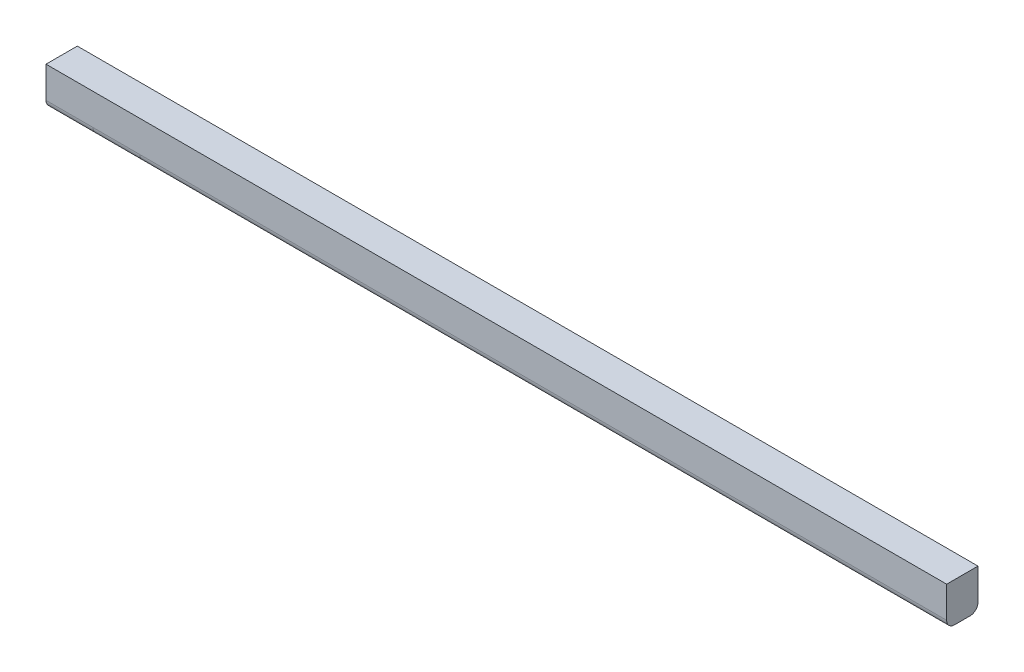
ISO-10303-21;
HEADER;
FILE_DESCRIPTION(('STEP AP214'),'2;1');
FILE_NAME('part.step','',(''),(''),'','','');
FILE_SCHEMA(('AUTOMOTIVE_DESIGN { 1 0 10303 214 1 1 1 1 }'));
ENDSEC;
DATA;
#1=APPLICATION_CONTEXT('core data for automotive mechanical design processes');
#2=APPLICATION_PROTOCOL_DEFINITION('international standard','automotive_design',2000,#1);
#3=PRODUCT_CONTEXT('',#1,'mechanical');
#4=PRODUCT('Part','Part','',(#3));
#5=PRODUCT_RELATED_PRODUCT_CATEGORY('part','',(#4));
#6=PRODUCT_DEFINITION_FORMATION('','',#4);
#7=PRODUCT_DEFINITION_CONTEXT('part definition',#1,'design');
#8=PRODUCT_DEFINITION('design','',#6,#7);
#9=PRODUCT_DEFINITION_SHAPE('','',#8);
#10=(LENGTH_UNIT() NAMED_UNIT(*) SI_UNIT(.MILLI.,.METRE.));
#11=(NAMED_UNIT(*) PLANE_ANGLE_UNIT() SI_UNIT($,.RADIAN.));
#12=(NAMED_UNIT(*) SI_UNIT($,.STERADIAN.) SOLID_ANGLE_UNIT());
#13=UNCERTAINTY_MEASURE_WITH_UNIT(LENGTH_MEASURE(1.E-05),#10,'distance_accuracy_value','');
#14=(GEOMETRIC_REPRESENTATION_CONTEXT(3) GLOBAL_UNCERTAINTY_ASSIGNED_CONTEXT((#13)) GLOBAL_UNIT_ASSIGNED_CONTEXT((#10,
#11,#12)) REPRESENTATION_CONTEXT('',''));
#15=CARTESIAN_POINT('',(0.,0.,0.));
#16=DIRECTION('',(0.,0.,1.));
#17=DIRECTION('',(1.,0.,0.));
#18=AXIS2_PLACEMENT_3D('',#15,#16,#17);
#19=CARTESIAN_POINT('',(115.,-4.,0.));
#20=DIRECTION('',(-1.,0.,0.));
#21=DIRECTION('',(0.,0.,1.));
#22=AXIS2_PLACEMENT_3D('',#19,#20,#21);
#23=CYLINDRICAL_SURFACE('',#22,1.);
#24=DIRECTION('',(-1.,0.,0.));
#25=VECTOR('',#24,1.);
#26=CARTESIAN_POINT('',(115.,-5.,0.));
#27=LINE('',#26,#25);
#28=CARTESIAN_POINT('',(12.,-5.,0.));
#29=VERTEX_POINT('',#28);
#30=CARTESIAN_POINT('',(102.,-5.,0.));
#31=VERTEX_POINT('',#30);
#32=EDGE_CURVE('E256',#29,#31,#27,.F.);
#33=ORIENTED_EDGE('',*,*,#32,.F.);
#34=CARTESIAN_POINT('',(12.,-4.,0.));
#35=DIRECTION('',(1.,0.,0.));
#36=DIRECTION('',(0.,0.,1.));
#37=AXIS2_PLACEMENT_3D('',#34,#35,#36);
#38=CIRCLE('',#37,1.);
#39=CARTESIAN_POINT('',(12.,-4.,-1.));
#40=VERTEX_POINT('',#39);
#41=EDGE_CURVE('E12',#29,#40,#38,.T.);
#42=ORIENTED_EDGE('',*,*,#41,.T.);
#43=DIRECTION('',(-1.,0.,0.));
#44=VECTOR('',#43,1.);
#45=CARTESIAN_POINT('',(115.,-4.,-1.));
#46=LINE('',#45,#44);
#47=CARTESIAN_POINT('',(115.,-4.,-1.));
#48=VERTEX_POINT('',#47);
#49=EDGE_CURVE('E179',#48,#40,#46,.T.);
#50=ORIENTED_EDGE('',*,*,#49,.F.);
#51=CARTESIAN_POINT('',(115.,-4.,0.));
#52=DIRECTION('',(1.,0.,0.));
#53=DIRECTION('',(0.,0.,-1.));
#54=AXIS2_PLACEMENT_3D('',#51,#52,#53);
#55=CIRCLE('',#54,1.);
#56=CARTESIAN_POINT('',(115.,-5.,0.));
#57=VERTEX_POINT('',#56);
#58=EDGE_CURVE('E141',#57,#48,#55,.T.);
#59=ORIENTED_EDGE('',*,*,#58,.F.);
#60=CARTESIAN_POINT('',(106.,-5.,0.));
#61=VERTEX_POINT('',#60);
#62=EDGE_CURVE('E193',#61,#57,#27,.F.);
#63=ORIENTED_EDGE('',*,*,#62,.F.);
#64=EDGE_CURVE('E253',#31,#61,#27,.F.);
#65=ORIENTED_EDGE('',*,*,#64,.F.);
#66=EDGE_LOOP('',(#33,#42,#50,#59,#63,#65));
#67=FACE_BOUND('',#66,.T.);
#68=ADVANCED_FACE('F44',(#67),#23,.T.);
#69=ORIENTED_EDGE('',*,*,#41,.F.);
#70=CARTESIAN_POINT('',(6.00000000000001,-5.,0.));
#71=VERTEX_POINT('',#70);
#72=EDGE_CURVE('E202',#71,#29,#27,.F.);
#73=ORIENTED_EDGE('',*,*,#72,.F.);
#74=CARTESIAN_POINT('',(6.00000000000001,-4.,0.));
#75=DIRECTION('',(1.,0.,0.));
#76=DIRECTION('',(0.,0.,1.));
#77=AXIS2_PLACEMENT_3D('',#74,#75,#76);
#78=CIRCLE('',#77,1.);
#79=CARTESIAN_POINT('',(6.00000000000001,-4.,-1.));
#80=VERTEX_POINT('',#79);
#81=EDGE_CURVE('E53',#71,#80,#78,.T.);
#82=ORIENTED_EDGE('',*,*,#81,.T.);
#83=EDGE_CURVE('E65',#40,#80,#46,.T.);
#84=ORIENTED_EDGE('',*,*,#83,.F.);
#85=EDGE_LOOP('',(#69,#73,#82,#84));
#86=FACE_BOUND('',#85,.T.);
#87=ADVANCED_FACE('F236',(#86),#23,.T.);
#88=CARTESIAN_POINT('',(115.,-4.,2.));
#89=DIRECTION('',(-1.,0.,0.));
#90=DIRECTION('',(0.,0.,1.));
#91=AXIS2_PLACEMENT_3D('',#88,#89,#90);
#92=CYLINDRICAL_SURFACE('',#91,1.);
#93=DIRECTION('',(-1.,0.,0.));
#94=VECTOR('',#93,1.);
#95=CARTESIAN_POINT('',(115.,-4.,3.));
#96=LINE('',#95,#94);
#97=CARTESIAN_POINT('',(12.,-4.,3.));
#98=VERTEX_POINT('',#97);
#99=CARTESIAN_POINT('',(115.,-4.,3.));
#100=VERTEX_POINT('',#99);
#101=EDGE_CURVE('E207',#98,#100,#96,.F.);
#102=ORIENTED_EDGE('',*,*,#101,.F.);
#103=CARTESIAN_POINT('',(12.,-4.,2.));
#104=DIRECTION('',(1.,0.,0.));
#105=DIRECTION('',(0.,0.,1.));
#106=AXIS2_PLACEMENT_3D('',#103,#104,#105);
#107=CIRCLE('',#106,1.);
#108=CARTESIAN_POINT('',(12.,-5.,2.));
#109=VERTEX_POINT('',#108);
#110=EDGE_CURVE('E230',#98,#109,#107,.T.);
#111=ORIENTED_EDGE('',*,*,#110,.T.);
#112=DIRECTION('',(-1.,0.,0.));
#113=VECTOR('',#112,1.);
#114=CARTESIAN_POINT('',(115.,-5.,2.));
#115=LINE('',#114,#113);
#116=CARTESIAN_POINT('',(102.,-5.,2.));
#117=VERTEX_POINT('',#116);
#118=EDGE_CURVE('E195',#117,#109,#115,.T.);
#119=ORIENTED_EDGE('',*,*,#118,.F.);
#120=CARTESIAN_POINT('',(106.,-5.,2.));
#121=VERTEX_POINT('',#120);
#122=EDGE_CURVE('E194',#121,#117,#115,.T.);
#123=ORIENTED_EDGE('',*,*,#122,.F.);
#124=CARTESIAN_POINT('',(115.,-5.,2.));
#125=VERTEX_POINT('',#124);
#126=EDGE_CURVE('E189',#125,#121,#115,.T.);
#127=ORIENTED_EDGE('',*,*,#126,.F.);
#128=CARTESIAN_POINT('',(115.,-4.,2.));
#129=DIRECTION('',(1.,0.,0.));
#130=DIRECTION('',(0.,0.,-1.));
#131=AXIS2_PLACEMENT_3D('',#128,#129,#130);
#132=CIRCLE('',#131,1.);
#133=EDGE_CURVE('E201',#100,#125,#132,.T.);
#134=ORIENTED_EDGE('',*,*,#133,.F.);
#135=EDGE_LOOP('',(#102,#111,#119,#123,#127,#134));
#136=FACE_BOUND('',#135,.T.);
#137=ADVANCED_FACE('F286',(#136),#92,.T.);
#138=ORIENTED_EDGE('',*,*,#110,.F.);
#139=CARTESIAN_POINT('',(6.00000000000001,-4.,3.));
#140=VERTEX_POINT('',#139);
#141=EDGE_CURVE('E213',#140,#98,#96,.F.);
#142=ORIENTED_EDGE('',*,*,#141,.F.);
#143=CARTESIAN_POINT('',(6.00000000000001,-4.,2.));
#144=DIRECTION('',(1.,0.,0.));
#145=DIRECTION('',(0.,0.,1.));
#146=AXIS2_PLACEMENT_3D('',#143,#144,#145);
#147=CIRCLE('',#146,1.);
#148=CARTESIAN_POINT('',(6.00000000000001,-5.,2.));
#149=VERTEX_POINT('',#148);
#150=EDGE_CURVE('E227',#140,#149,#147,.T.);
#151=ORIENTED_EDGE('',*,*,#150,.T.);
#152=EDGE_CURVE('E196',#109,#149,#115,.T.);
#153=ORIENTED_EDGE('',*,*,#152,.F.);
#154=EDGE_LOOP('',(#138,#142,#151,#153));
#155=FACE_BOUND('',#154,.T.);
#156=ADVANCED_FACE('F280',(#155),#92,.T.);
#157=CARTESIAN_POINT('',(115.,-5.,3.));
#158=DIRECTION('',(0.,1.,0.));
#159=DIRECTION('',(0.,0.,1.));
#160=AXIS2_PLACEMENT_3D('',#157,#158,#159);
#161=PLANE('',#160);
#162=DIRECTION('',(0.,0.,-1.));
#163=VECTOR('',#162,1.);
#164=CARTESIAN_POINT('',(102.,-5.,3.));
#165=LINE('',#164,#163);
#166=EDGE_CURVE('E224',#117,#31,#165,.T.);
#167=ORIENTED_EDGE('',*,*,#166,.F.);
#168=ORIENTED_EDGE('',*,*,#118,.T.);
#169=DIRECTION('',(0.,0.,1.));
#170=VECTOR('',#169,1.);
#171=CARTESIAN_POINT('',(12.,-5.,3.));
#172=LINE('',#171,#170);
#173=EDGE_CURVE('E212',#29,#109,#172,.T.);
#174=ORIENTED_EDGE('',*,*,#173,.F.);
#175=ORIENTED_EDGE('',*,*,#32,.T.);
#176=EDGE_LOOP('',(#167,#168,#174,#175));
#177=FACE_BOUND('',#176,.T.);
#178=ADVANCED_FACE('F300',(#177),#161,.F.);
#179=DIRECTION('',(0.,0.,1.));
#180=VECTOR('',#179,1.);
#181=CARTESIAN_POINT('',(106.,-5.,3.));
#182=LINE('',#181,#180);
#183=EDGE_CURVE('E221',#61,#121,#182,.T.);
#184=ORIENTED_EDGE('',*,*,#183,.F.);
#185=ORIENTED_EDGE('',*,*,#62,.T.);
#186=DIRECTION('',(0.,0.,-1.));
#187=VECTOR('',#186,1.);
#188=CARTESIAN_POINT('',(115.,-5.,3.));
#189=LINE('',#188,#187);
#190=EDGE_CURVE('E143',#125,#57,#189,.T.);
#191=ORIENTED_EDGE('',*,*,#190,.F.);
#192=ORIENTED_EDGE('',*,*,#126,.T.);
#193=EDGE_LOOP('',(#184,#185,#191,#192));
#194=FACE_BOUND('',#193,.T.);
#195=ADVANCED_FACE('F291',(#194),#161,.F.);
#196=DIRECTION('',(0.,0.,-1.));
#197=VECTOR('',#196,1.);
#198=CARTESIAN_POINT('',(6.00000000000001,-5.,3.));
#199=LINE('',#198,#197);
#200=EDGE_CURVE('E217',#149,#71,#199,.T.);
#201=ORIENTED_EDGE('',*,*,#200,.F.);
#202=CARTESIAN_POINT('',(0.,-5.,2.));
#203=VERTEX_POINT('',#202);
#204=EDGE_CURVE('E188',#149,#203,#115,.T.);
#205=ORIENTED_EDGE('',*,*,#204,.T.);
#206=DIRECTION('',(0.,0.,-1.));
#207=VECTOR('',#206,1.);
#208=CARTESIAN_POINT('',(0.,-5.,3.));
#209=LINE('',#208,#207);
#210=CARTESIAN_POINT('',(0.,-5.,0.));
#211=VERTEX_POINT('',#210);
#212=EDGE_CURVE('E169',#203,#211,#209,.T.);
#213=ORIENTED_EDGE('',*,*,#212,.T.);
#214=EDGE_CURVE('E197',#211,#71,#27,.F.);
#215=ORIENTED_EDGE('',*,*,#214,.T.);
#216=EDGE_LOOP('',(#201,#205,#213,#215));
#217=FACE_BOUND('',#216,.T.);
#218=ADVANCED_FACE('F306',(#217),#161,.F.);
#219=ORIENTED_EDGE('',*,*,#122,.T.);
#220=ORIENTED_EDGE('',*,*,#166,.T.);
#221=ORIENTED_EDGE('',*,*,#64,.T.);
#222=ORIENTED_EDGE('',*,*,#183,.T.);
#223=EDGE_LOOP('',(#219,#220,#221,#222));
#224=FACE_BOUND('',#223,.T.);
#225=ADVANCED_FACE('F298',(#224),#161,.F.);
#226=CARTESIAN_POINT('',(115.,0.,3.));
#227=DIRECTION('',(0.,0.,-1.));
#228=DIRECTION('',(-1.,0.,0.));
#229=AXIS2_PLACEMENT_3D('',#226,#227,#228);
#230=PLANE('',#229);
#231=DIRECTION('',(0.,-1.,0.));
#232=VECTOR('',#231,1.);
#233=CARTESIAN_POINT('',(0.,0.,3.));
#234=LINE('',#233,#232);
#235=CARTESIAN_POINT('',(0.,0.,3.));
#236=VERTEX_POINT('',#235);
#237=CARTESIAN_POINT('',(0.,-4.,3.));
#238=VERTEX_POINT('',#237);
#239=EDGE_CURVE('E165',#236,#238,#234,.T.);
#240=ORIENTED_EDGE('',*,*,#239,.T.);
#241=EDGE_CURVE('E208',#238,#140,#96,.F.);
#242=ORIENTED_EDGE('',*,*,#241,.T.);
#243=ORIENTED_EDGE('',*,*,#141,.T.);
#244=ORIENTED_EDGE('',*,*,#101,.T.);
#245=DIRECTION('',(0.,-1.,0.));
#246=VECTOR('',#245,1.);
#247=CARTESIAN_POINT('',(115.,0.,3.));
#248=LINE('',#247,#246);
#249=CARTESIAN_POINT('',(115.,0.,3.));
#250=VERTEX_POINT('',#249);
#251=EDGE_CURVE('E177',#250,#100,#248,.T.);
#252=ORIENTED_EDGE('',*,*,#251,.F.);
#253=DIRECTION('',(-1.,0.,0.));
#254=VECTOR('',#253,1.);
#255=CARTESIAN_POINT('',(115.,0.,3.));
#256=LINE('',#255,#254);
#257=EDGE_CURVE('E154',#250,#236,#256,.T.);
#258=ORIENTED_EDGE('',*,*,#257,.T.);
#259=EDGE_LOOP('',(#240,#242,#243,#244,#252,#258));
#260=FACE_BOUND('',#259,.T.);
#261=ADVANCED_FACE('F276',(#260),#230,.F.);
#262=ORIENTED_EDGE('',*,*,#152,.T.);
#263=ORIENTED_EDGE('',*,*,#200,.T.);
#264=ORIENTED_EDGE('',*,*,#72,.T.);
#265=ORIENTED_EDGE('',*,*,#173,.T.);
#266=EDGE_LOOP('',(#262,#263,#264,#265));
#267=FACE_BOUND('',#266,.T.);
#268=ADVANCED_FACE('F303',(#267),#161,.F.);
#269=CARTESIAN_POINT('',(115.,0.,-1.));
#270=DIRECTION('',(0.,0.,1.));
#271=DIRECTION('',(0.,-1.,0.));
#272=AXIS2_PLACEMENT_3D('',#269,#270,#271);
#273=PLANE('',#272);
#274=DIRECTION('',(0.,1.,0.));
#275=VECTOR('',#274,1.);
#276=CARTESIAN_POINT('',(115.,0.,-1.));
#277=LINE('',#276,#275);
#278=CARTESIAN_POINT('',(115.,0.,-1.));
#279=VERTEX_POINT('',#278);
#280=EDGE_CURVE('E132',#48,#279,#277,.T.);
#281=ORIENTED_EDGE('',*,*,#280,.F.);
#282=ORIENTED_EDGE('',*,*,#49,.T.);
#283=ORIENTED_EDGE('',*,*,#83,.T.);
#284=CARTESIAN_POINT('',(0.,-4.,-1.));
#285=VERTEX_POINT('',#284);
#286=EDGE_CURVE('E153',#80,#285,#46,.T.);
#287=ORIENTED_EDGE('',*,*,#286,.T.);
#288=DIRECTION('',(0.,1.,0.));
#289=VECTOR('',#288,1.);
#290=CARTESIAN_POINT('',(0.,0.,-1.));
#291=LINE('',#290,#289);
#292=CARTESIAN_POINT('',(0.,0.,-1.));
#293=VERTEX_POINT('',#292);
#294=EDGE_CURVE('E149',#285,#293,#291,.T.);
#295=ORIENTED_EDGE('',*,*,#294,.T.);
#296=DIRECTION('',(-1.,0.,0.));
#297=VECTOR('',#296,1.);
#298=CARTESIAN_POINT('',(115.,0.,-1.));
#299=LINE('',#298,#297);
#300=EDGE_CURVE('E146',#279,#293,#299,.T.);
#301=ORIENTED_EDGE('',*,*,#300,.F.);
#302=EDGE_LOOP('',(#281,#282,#283,#287,#295,#301));
#303=FACE_BOUND('',#302,.T.);
#304=ADVANCED_FACE('F147',(#303),#273,.F.);
#305=CARTESIAN_POINT('',(115.,0.,3.));
#306=DIRECTION('',(0.,-1.,0.));
#307=DIRECTION('',(0.,0.,-1.));
#308=AXIS2_PLACEMENT_3D('',#305,#306,#307);
#309=PLANE('',#308);
#310=DIRECTION('',(0.,0.,1.));
#311=VECTOR('',#310,1.);
#312=CARTESIAN_POINT('',(0.,0.,3.));
#313=LINE('',#312,#311);
#314=EDGE_CURVE('E175',#293,#236,#313,.T.);
#315=ORIENTED_EDGE('',*,*,#314,.T.);
#316=ORIENTED_EDGE('',*,*,#257,.F.);
#317=DIRECTION('',(0.,0.,1.));
#318=VECTOR('',#317,1.);
#319=CARTESIAN_POINT('',(115.,0.,3.));
#320=LINE('',#319,#318);
#321=EDGE_CURVE('E138',#279,#250,#320,.T.);
#322=ORIENTED_EDGE('',*,*,#321,.F.);
#323=ORIENTED_EDGE('',*,*,#300,.T.);
#324=EDGE_LOOP('',(#315,#316,#322,#323));
#325=FACE_BOUND('',#324,.T.);
#326=ADVANCED_FACE('F156',(#325),#309,.F.);
#327=CARTESIAN_POINT('',(115.,0.,0.));
#328=DIRECTION('',(1.,0.,0.));
#329=DIRECTION('',(0.,0.,-1.));
#330=AXIS2_PLACEMENT_3D('',#327,#328,#329);
#331=PLANE('',#330);
#332=ORIENTED_EDGE('',*,*,#190,.T.);
#333=ORIENTED_EDGE('',*,*,#58,.T.);
#334=ORIENTED_EDGE('',*,*,#280,.T.);
#335=ORIENTED_EDGE('',*,*,#321,.T.);
#336=ORIENTED_EDGE('',*,*,#251,.T.);
#337=ORIENTED_EDGE('',*,*,#133,.T.);
#338=EDGE_LOOP('',(#332,#333,#334,#335,#336,#337));
#339=FACE_BOUND('',#338,.T.);
#340=ADVANCED_FACE('F135',(#339),#331,.T.);
#341=CARTESIAN_POINT('',(0.,0.,0.));
#342=DIRECTION('',(1.,0.,0.));
#343=DIRECTION('',(0.,0.,-1.));
#344=AXIS2_PLACEMENT_3D('',#341,#342,#343);
#345=PLANE('',#344);
#346=ORIENTED_EDGE('',*,*,#294,.F.);
#347=CARTESIAN_POINT('',(0.,-4.,0.));
#348=DIRECTION('',(1.,0.,0.));
#349=DIRECTION('',(0.,0.,-1.));
#350=AXIS2_PLACEMENT_3D('',#347,#348,#349);
#351=CIRCLE('',#350,1.);
#352=EDGE_CURVE('E185',#285,#211,#351,.F.);
#353=ORIENTED_EDGE('',*,*,#352,.T.);
#354=ORIENTED_EDGE('',*,*,#212,.F.);
#355=CARTESIAN_POINT('',(0.,-4.,2.));
#356=DIRECTION('',(1.,0.,0.));
#357=DIRECTION('',(0.,0.,-1.));
#358=AXIS2_PLACEMENT_3D('',#355,#356,#357);
#359=CIRCLE('',#358,1.);
#360=EDGE_CURVE('E182',#203,#238,#359,.F.);
#361=ORIENTED_EDGE('',*,*,#360,.T.);
#362=ORIENTED_EDGE('',*,*,#239,.F.);
#363=ORIENTED_EDGE('',*,*,#314,.F.);
#364=EDGE_LOOP('',(#346,#353,#354,#361,#362,#363));
#365=FACE_BOUND('',#364,.T.);
#366=ADVANCED_FACE('F312',(#365),#345,.F.);
#367=ORIENTED_EDGE('',*,*,#81,.F.);
#368=ORIENTED_EDGE('',*,*,#214,.F.);
#369=ORIENTED_EDGE('',*,*,#352,.F.);
#370=ORIENTED_EDGE('',*,*,#286,.F.);
#371=EDGE_LOOP('',(#367,#368,#369,#370));
#372=FACE_BOUND('',#371,.T.);
#373=ADVANCED_FACE('F241',(#372),#23,.T.);
#374=ORIENTED_EDGE('',*,*,#150,.F.);
#375=ORIENTED_EDGE('',*,*,#241,.F.);
#376=ORIENTED_EDGE('',*,*,#360,.F.);
#377=ORIENTED_EDGE('',*,*,#204,.F.);
#378=EDGE_LOOP('',(#374,#375,#376,#377));
#379=FACE_BOUND('',#378,.T.);
#380=ADVANCED_FACE('F46',(#379),#92,.T.);
#381=CLOSED_SHELL('',(#68,#87,#137,#156,#178,#195,#218,#225,#261,#268,#304,#326,#340,#366,#373,#380));
#382=MANIFOLD_SOLID_BREP('B2',#381);
#383=ADVANCED_BREP_SHAPE_REPRESENTATION('',(#18,#382),#14);
#384=SHAPE_DEFINITION_REPRESENTATION(#9,#383);
ENDSEC;
END-ISO-10303-21;
